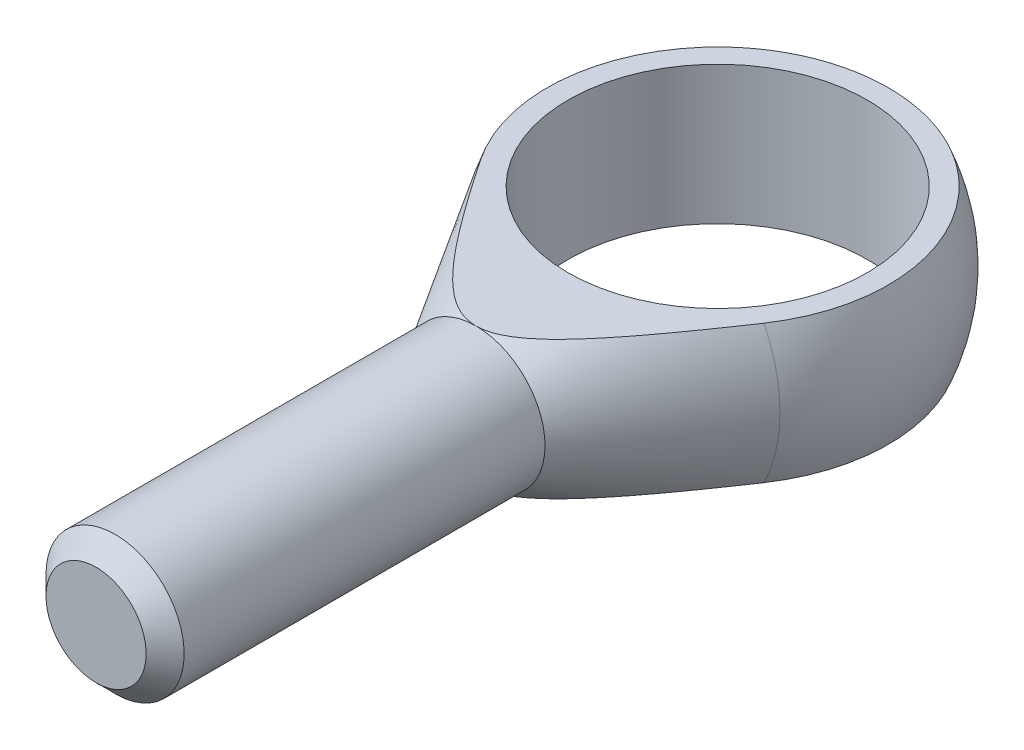
ISO-10303-21;
HEADER;
FILE_DESCRIPTION(('STEP AP214'),'2;1');
FILE_NAME('part.step','',(''),(''),'','','');
FILE_SCHEMA(('AUTOMOTIVE_DESIGN { 1 0 10303 214 1 1 1 1 }'));
ENDSEC;
DATA;
#1=APPLICATION_CONTEXT('core data for automotive mechanical design processes');
#2=APPLICATION_PROTOCOL_DEFINITION('international standard','automotive_design',2000,#1);
#3=PRODUCT_CONTEXT('',#1,'mechanical');
#4=PRODUCT('Part','Part','',(#3));
#5=PRODUCT_RELATED_PRODUCT_CATEGORY('part','',(#4));
#6=PRODUCT_DEFINITION_FORMATION('','',#4);
#7=PRODUCT_DEFINITION_CONTEXT('part definition',#1,'design');
#8=PRODUCT_DEFINITION('design','',#6,#7);
#9=PRODUCT_DEFINITION_SHAPE('','',#8);
#10=(LENGTH_UNIT() NAMED_UNIT(*) SI_UNIT(.MILLI.,.METRE.));
#11=(NAMED_UNIT(*) PLANE_ANGLE_UNIT() SI_UNIT($,.RADIAN.));
#12=(NAMED_UNIT(*) SI_UNIT($,.STERADIAN.) SOLID_ANGLE_UNIT());
#13=UNCERTAINTY_MEASURE_WITH_UNIT(LENGTH_MEASURE(1.E-05),#10,'distance_accuracy_value','');
#14=(GEOMETRIC_REPRESENTATION_CONTEXT(3) GLOBAL_UNCERTAINTY_ASSIGNED_CONTEXT((#13)) GLOBAL_UNIT_ASSIGNED_CONTEXT((#10,
#11,#12)) REPRESENTATION_CONTEXT('',''));
#15=CARTESIAN_POINT('',(0.,0.,0.));
#16=DIRECTION('',(0.,0.,1.));
#17=DIRECTION('',(1.,0.,0.));
#18=AXIS2_PLACEMENT_3D('',#15,#16,#17);
#19=CARTESIAN_POINT('',(0.,0.,21.));
#20=DIRECTION('',(0.,0.,-1.));
#21=DIRECTION('',(-1.,0.,0.));
#22=AXIS2_PLACEMENT_3D('',#19,#20,#21);
#23=CONICAL_SURFACE('',#22,6.,0.54381913603572);
#24=CARTESIAN_POINT('',(0.,0.,8.27852704456483));
#25=DIRECTION('',(0.,0.,-1.));
#26=DIRECTION('',(-1.,0.,0.));
#27=AXIS2_PLACEMENT_3D('',#24,#25,#26);
#28=CIRCLE('',#27,13.6918220106898);
#29=CARTESIAN_POINT('',(-12.3071519846148,-6.,8.27852704456483));
#30=VERTEX_POINT('',#29);
#31=CARTESIAN_POINT('',(-12.3071519846148,6.,8.27852704456483));
#32=VERTEX_POINT('',#31);
#33=EDGE_CURVE('E96',#30,#32,#28,.T.);
#34=ORIENTED_EDGE('',*,*,#33,.F.);
#35=CARTESIAN_POINT('',(-31.3799882104958,-6.,-21.9160405435385));
#36=CARTESIAN_POINT('',(-30.9346155893106,-6.,-21.1925500495504));
#37=CARTESIAN_POINT('',(-30.4890034582179,-6.,-20.4692070155686));
#38=CARTESIAN_POINT('',(-29.5972262334052,-6.,-19.022861540835));
#39=CARTESIAN_POINT('',(-29.1510611394851,-6.,-18.2998591002066));
#40=CARTESIAN_POINT('',(-27.8115766615616,-6.,-16.1313521166251));
#41=CARTESIAN_POINT('',(-26.9173172646921,-6.,-14.6864278449652));
#42=CARTESIAN_POINT('',(-25.1235923096148,-6.,-11.7956444903462));
#43=CARTESIAN_POINT('',(-24.2241197878063,-6.,-10.3497897269972));
#44=CARTESIAN_POINT('',(-22.4206158394495,-6.,-7.46102313765912));
#45=CARTESIAN_POINT('',(-21.5165846430345,-6.,-6.01811116817422));
#46=CARTESIAN_POINT('',(-20.126860696282,-6.,-3.81129437405455));
#47=CARTESIAN_POINT('',(-19.6435464141357,-6.,-3.04589194963399));
#48=CARTESIAN_POINT('',(-18.6745854110955,-6.,-1.51656533446917));
#49=CARTESIAN_POINT('',(-18.1889386929651,-6.,-0.75264114197502));
#50=CARTESIAN_POINT('',(-17.2146421972767,-6.,0.773463680413597));
#51=CARTESIAN_POINT('',(-16.7259919498118,-6.,1.53564401048951));
#52=CARTESIAN_POINT('',(-15.7449501334085,-6.,3.05758567398117));
#53=CARTESIAN_POINT('',(-15.2525585992186,-6.,3.81734702977121));
#54=CARTESIAN_POINT('',(-14.2634801806534,-6.,5.33272583238984));
#55=CARTESIAN_POINT('',(-13.766799392861,-6.,6.08834725487742));
#56=CARTESIAN_POINT('',(-12.7668366966786,-6.,7.59526672419474));
#57=CARTESIAN_POINT('',(-12.2635545265885,-6.,8.34656459791599));
#58=CARTESIAN_POINT('',(-11.5017822788204,-6.,9.46871748550414));
#59=CARTESIAN_POINT('',(-11.2467510177423,-6.,9.84192022113506));
#60=CARTESIAN_POINT('',(-10.7339025234583,-6.,10.5864052204217));
#61=CARTESIAN_POINT('',(-10.4760853093945,-6.,10.9576874972468));
#62=CARTESIAN_POINT('',(-9.95708575881299,-6.,11.6978551503882));
#63=CARTESIAN_POINT('',(-9.69590366612362,-6.,12.0667406974964));
#64=CARTESIAN_POINT('',(-9.16937247619287,-6.,12.8015219736493));
#65=CARTESIAN_POINT('',(-8.90402346502942,-6.,13.1674177642181));
#66=CARTESIAN_POINT('',(-8.460014194362,-6.,13.7704906969663));
#67=CARTESIAN_POINT('',(-8.28284323101851,-6.,14.0087640172321));
#68=CARTESIAN_POINT('',(-7.92583684483059,-6.,14.48331778095));
#69=CARTESIAN_POINT('',(-7.74600136081962,-6.,14.7195981784568));
#70=CARTESIAN_POINT('',(-7.38305426531327,-6.,15.1898992353419));
#71=CARTESIAN_POINT('',(-7.19994043221562,-6.,15.4239181830393));
#72=CARTESIAN_POINT('',(-6.82994411624043,-6.,15.8889550963289));
#73=CARTESIAN_POINT('',(-6.64306172541067,-6.,16.1199731349927));
#74=CARTESIAN_POINT('',(-6.26537430423413,-6.,16.577467845376));
#75=CARTESIAN_POINT('',(-6.07458481474136,-6.,16.803957312042));
#76=CARTESIAN_POINT('',(-5.68745941935048,-6.,17.2521406916316));
#77=CARTESIAN_POINT('',(-5.49112386393112,-6.,17.4738349060306));
#78=CARTESIAN_POINT('',(-5.09175015278233,-6.,17.910725013741));
#79=CARTESIAN_POINT('',(-4.88871884774234,-6.,18.125927142489));
#80=CARTESIAN_POINT('',(-4.47404371281153,-6.,18.5478259059901));
#81=CARTESIAN_POINT('',(-4.26240251355695,-6.,18.7545251004523));
#82=CARTESIAN_POINT('',(-3.88946376517466,-6.,19.0993151487996));
#83=CARTESIAN_POINT('',(-3.73084066141112,-6.,19.240287631417));
#84=CARTESIAN_POINT('',(-3.40674953052468,-6.,19.5143095980893));
#85=CARTESIAN_POINT('',(-3.24127918962299,-6.,19.6473563662652));
#86=CARTESIAN_POINT('',(-2.90281116121088,-6.,19.9024579565511));
#87=CARTESIAN_POINT('',(-2.72983943598837,-6.,20.024546803352));
#88=CARTESIAN_POINT('',(-2.37476302906092,-6.,20.2544269996832));
#89=CARTESIAN_POINT('',(-2.19266585087034,-6.,20.3622298385993));
#90=CARTESIAN_POINT('',(-1.7965747978339,-6.,20.5698544641381));
#91=CARTESIAN_POINT('',(-1.58131425638325,-6.,20.6673552282702));
#92=CARTESIAN_POINT('',(-1.24943088724608,-6.,20.7886986837656));
#93=CARTESIAN_POINT('',(-1.13732563638951,-6.,20.8249908644043));
#94=CARTESIAN_POINT('',(-0.910500826215442,-6.,20.8880927750263));
#95=CARTESIAN_POINT('',(-0.795782675289699,-6.,20.91490749051));
#96=CARTESIAN_POINT('',(-0.562915670696806,-6.,20.9582813929463));
#97=CARTESIAN_POINT('',(-0.444741850116909,-6.,20.9747080433463));
#98=CARTESIAN_POINT('',(-0.207353172159811,-6.,20.9960101114955));
#99=CARTESIAN_POINT('',(-0.0881383988865509,-6.,21.0008864539429));
#100=CARTESIAN_POINT('',(0.150170722889329,-6.,20.9988483726897));
#101=CARTESIAN_POINT('',(0.269265087453287,-6.,20.991935813276));
#102=CARTESIAN_POINT('',(0.506229209827387,-6.,20.9666640842946));
#103=CARTESIAN_POINT('',(0.624098810252515,-6.,20.9483034616746));
#104=CARTESIAN_POINT('',(0.870063607691504,-6.,20.8984503753296));
#105=CARTESIAN_POINT('',(0.997916706362346,-6.,20.865771218156));
#106=CARTESIAN_POINT('',(1.25014820189205,-6.,20.7889631603308));
#107=CARTESIAN_POINT('',(1.37452498767296,-6.,20.7448290453001));
#108=CARTESIAN_POINT('',(1.61959187065122,-6.,20.6467170078992));
#109=CARTESIAN_POINT('',(1.74027380218476,-6.,20.5927188950233));
#110=CARTESIAN_POINT('',(1.97759984990636,-6.,20.4765579671671));
#111=CARTESIAN_POINT('',(2.0942440478626,-6.,20.4143953176493));
#112=CARTESIAN_POINT('',(2.34728797757201,-6.,20.2698082894266));
#113=CARTESIAN_POINT('',(2.48280610860327,-6.,20.1858481797006));
#114=CARTESIAN_POINT('',(2.7486994638737,-6.,20.0101070576492));
#115=CARTESIAN_POINT('',(2.87907259019253,-6.,19.9183229022359));
#116=CARTESIAN_POINT('',(3.13537706565216,-6.,19.728388023541));
#117=CARTESIAN_POINT('',(3.26130133672617,-6.,19.6302278032431));
#118=CARTESIAN_POINT('',(3.50906304279529,-6.,19.4288721941432));
#119=CARTESIAN_POINT('',(3.63089995524097,-6.,19.3256761656454));
#120=CARTESIAN_POINT('',(3.87181155020788,-6.,19.1144634557711));
#121=CARTESIAN_POINT('',(3.99086110302297,-6.,19.0064182196495));
#122=CARTESIAN_POINT('',(4.22576989320534,-6.,18.7869184222835));
#123=CARTESIAN_POINT('',(4.34162904722421,-6.,18.6754637721292));
#124=CARTESIAN_POINT('',(4.57043082921461,-6.,18.4498409654308));
#125=CARTESIAN_POINT('',(4.68337635623869,-6.,18.3356757417746));
#126=CARTESIAN_POINT('',(4.90680448753394,-6.,18.1049746094091));
#127=CARTESIAN_POINT('',(5.01728718070854,-6.,17.9884387865651));
#128=CARTESIAN_POINT('',(5.36612173955582,-6.,17.6136742787642));
#129=CARTESIAN_POINT('',(5.60039459573932,-6.,17.351645352019));
#130=CARTESIAN_POINT('',(6.06102141083565,-6.,16.8206958939175));
#131=CARTESIAN_POINT('',(6.28737396203295,-6.,16.5517741520343));
#132=CARTESIAN_POINT('',(6.73394561712576,-6.,16.0086519655853));
#133=CARTESIAN_POINT('',(6.95416129148376,-6.,15.7344487087099));
#134=CARTESIAN_POINT('',(7.38959022012685,-6.,15.1820958625112));
#135=CARTESIAN_POINT('',(7.60480329932923,-6.,14.9039461356149));
#136=CARTESIAN_POINT('',(8.03161304260166,-6.,14.3439535338031));
#137=CARTESIAN_POINT('',(8.24320101632604,-6.,14.0621040483462));
#138=CARTESIAN_POINT('',(8.66301230278849,-6.,13.4959083591818));
#139=CARTESIAN_POINT('',(8.87123556827255,-6.,13.2115621204962));
#140=CARTESIAN_POINT('',(9.28480487958707,-6.,12.6409339975004));
#141=CARTESIAN_POINT('',(9.49015187484745,-6.,12.3546528004816));
#142=CARTESIAN_POINT('',(9.89847885118036,-6.,11.7804061382996));
#143=CARTESIAN_POINT('',(10.1014588147406,-6.,11.492440660699));
#144=CARTESIAN_POINT('',(10.7070127814102,-6.,10.6269859232812));
#145=CARTESIAN_POINT('',(11.106589327327,-6.,10.047399243146));
#146=CARTESIAN_POINT('',(11.8998426580399,-6.,8.88414957701882));
#147=CARTESIAN_POINT('',(12.293518981256,-6.,8.30048627729143));
#148=CARTESIAN_POINT('',(13.0758336013582,-6.,7.13085972480483));
#149=CARTESIAN_POINT('',(13.4644776187565,-6.,6.54490029437336));
#150=CARTESIAN_POINT('',(14.2382073625244,-6.,5.37066039390251));
#151=CARTESIAN_POINT('',(14.62329317672,-6.,4.78237998166535));
#152=CARTESIAN_POINT('',(15.3585771337857,-6.,3.65320122392585));
#153=CARTESIAN_POINT('',(15.7090021166038,-6.,3.11245047524019));
#154=CARTESIAN_POINT('',(16.4078846217464,-6.,2.02967869372597));
#155=CARTESIAN_POINT('',(16.7563421413753,-6.,1.48765765915846));
#156=CARTESIAN_POINT('',(17.7992758967793,-6.,-0.139985997389402));
#157=CARTESIAN_POINT('',(18.491305096419,-6.,-1.22717649251654));
#158=CARTESIAN_POINT('',(19.8710458348003,-6.,-3.40507585619151));
#159=CARTESIAN_POINT('',(20.5587549599765,-6.,-4.4957862514136));
#160=CARTESIAN_POINT('',(21.9306838432565,-6.,-6.67940044412453));
#161=CARTESIAN_POINT('',(22.614903596599,-6.,-7.77230424460346));
#162=CARTESIAN_POINT('',(23.9754505739948,-6.,-9.95140679246916));
#163=CARTESIAN_POINT('',(24.6517981283151,-6.,-11.0375928533262));
#164=CARTESIAN_POINT('',(26.0024350837802,-6.,-13.2112462075492));
#165=CARTESIAN_POINT('',(26.6767244811887,-6.,-14.2987135032362));
#166=CARTESIAN_POINT('',(28.0232688371092,-6.,-16.474024708846));
#167=CARTESIAN_POINT('',(28.6955247567213,-6.,-17.5618680240207));
#168=CARTESIAN_POINT('',(30.0386913186117,-6.,-19.7383803061851));
#169=CARTESIAN_POINT('',(30.7096019650269,-6.,-20.8270492706215));
#170=CARTESIAN_POINT('',(31.3799882104958,-6.,-21.9160405435385));
#171=B_SPLINE_CURVE_WITH_KNOTS('',3,(#35,#36,#37,#38,#39,#40,#41,#42,#43,#44,#45,#46,#47,#48,
#49,#50,#51,#52,#53,#54,#55,#56,#57,#58,#59,#60,#61,#62,#63,#64,#65,#66,#67,#68,#69,#70,#71,#72,
#73,#74,#75,#76,#77,#78,#79,#80,#81,#82,#83,#84,#85,#86,#87,#88,#89,#90,#91,#92,#93,#94,#95,#96,
#97,#98,#99,#100,#101,#102,#103,#104,#105,#106,#107,#108,#109,#110,#111,#112,#113,#114,#115,
#116,#117,#118,#119,#120,#121,#122,#123,#124,#125,#126,#127,#128,#129,#130,#131,#132,#133,#134,
#135,#136,#137,#138,#139,#140,#141,#142,#143,#144,#145,#146,#147,#148,#149,#150,#151,#152,#153,
#154,#155,#156,#157,#158,#159,#160,#161,#162,#163,#164,#165,#166,#167,#168,#169,#170),
.UNSPECIFIED.,.F.,.F.,(4,2,2,2,2,2,2,2,2,2,2,2,2,2,2,2,2,2,2,2,2,2,2,2,2,2,2,2,2,2,2,2,2,2,2,2,
2,2,2,2,2,2,2,2,2,2,2,2,2,2,2,2,2,2,2,2,2,2,2,2,2,2,2,2,2,2,2,4),(0.,2.54875593193632,
5.09751278693731,10.1953080539329,15.3037194775998,20.4118755473142,23.1275494787357,
25.8432201934323,28.5593271800134,31.2754089705693,33.9881162986551,36.7009314942169,
38.0569789987539,39.4130171918848,40.7689576693249,42.1248701732329,43.0156265925406,
43.9064034917678,44.7978087762971,45.689192314384,46.5775376812096,47.4658270348714,
48.3532341405091,49.240372117877,49.8768137316226,50.5134721929115,51.148079979075,
51.7821742498355,52.4887532523772,52.8419137574872,53.1948882095245,53.5522797734834,
53.9096427243062,54.2669491672919,54.6243009708509,55.0195714569588,55.4150221895645,
55.8112916253154,56.2075530315105,56.685462870433,57.1635656090708,57.642397568746,
58.1212905133223,58.6035168332439,59.085755739283,59.5674947065795,60.0492162558008,
61.1034322397133,62.1578346526929,63.2128149498721,64.267832114227,65.3250990205127,
66.3823807621877,67.4393048652418,68.4962367829284,70.6081073333659,72.7201422440188,
74.829517243714,76.9388400385749,78.8719365042182,80.8050356177013,84.6712791975568,
88.5395188314093,92.4077637421059,96.246408577892,100.085060377907,103.921461286108,
107.757850378947),.UNSPECIFIED.);
#172=CARTESIAN_POINT('',(0.,-6.,21.));
#173=VERTEX_POINT('',#172);
#174=EDGE_CURVE('E92',#30,#173,#171,.T.);
#175=ORIENTED_EDGE('',*,*,#174,.T.);
#176=CARTESIAN_POINT('',(0.,0.,21.));
#177=DIRECTION('',(0.,0.,-1.));
#178=DIRECTION('',(-1.,0.,0.));
#179=AXIS2_PLACEMENT_3D('',#176,#177,#178);
#180=CIRCLE('',#179,6.);
#181=CARTESIAN_POINT('',(0.,6.,21.));
#182=VERTEX_POINT('',#181);
#183=EDGE_CURVE('E91',#173,#182,#180,.T.);
#184=ORIENTED_EDGE('',*,*,#183,.T.);
#185=CARTESIAN_POINT('',(31.3799882104958,6.,-21.9160405435385));
#186=CARTESIAN_POINT('',(30.9346155893106,6.,-21.1925500495504));
#187=CARTESIAN_POINT('',(30.4890034582179,6.,-20.4692070155686));
#188=CARTESIAN_POINT('',(29.5972262334052,6.,-19.022861540835));
#189=CARTESIAN_POINT('',(29.1510611394851,6.,-18.2998591002066));
#190=CARTESIAN_POINT('',(27.8115766615616,6.,-16.1313521166251));
#191=CARTESIAN_POINT('',(26.9173172646921,6.,-14.6864278449652));
#192=CARTESIAN_POINT('',(25.1235923096148,6.,-11.7956444903462));
#193=CARTESIAN_POINT('',(24.2241197878063,6.,-10.3497897269972));
#194=CARTESIAN_POINT('',(22.4206158394495,6.,-7.46102313765912));
#195=CARTESIAN_POINT('',(21.5165846430345,6.,-6.01811116817422));
#196=CARTESIAN_POINT('',(20.126860696282,6.,-3.81129437405455));
#197=CARTESIAN_POINT('',(19.6435464141357,6.,-3.04589194963399));
#198=CARTESIAN_POINT('',(18.6745854110955,6.,-1.51656533446917));
#199=CARTESIAN_POINT('',(18.1889386929651,6.,-0.75264114197502));
#200=CARTESIAN_POINT('',(17.2146421972767,6.,0.773463680413597));
#201=CARTESIAN_POINT('',(16.7259919498118,6.,1.53564401048951));
#202=CARTESIAN_POINT('',(15.7449501334085,6.,3.05758567398117));
#203=CARTESIAN_POINT('',(15.2525585992186,6.,3.81734702977121));
#204=CARTESIAN_POINT('',(14.2634801806534,6.,5.33272583238984));
#205=CARTESIAN_POINT('',(13.766799392861,6.,6.08834725487742));
#206=CARTESIAN_POINT('',(12.7668366966786,6.,7.59526672419474));
#207=CARTESIAN_POINT('',(12.2635545265885,6.,8.34656459791599));
#208=CARTESIAN_POINT('',(11.5017822788204,6.,9.46871748550414));
#209=CARTESIAN_POINT('',(11.2467510177423,6.,9.84192022113506));
#210=CARTESIAN_POINT('',(10.7339025234583,6.,10.5864052204217));
#211=CARTESIAN_POINT('',(10.4760853093945,6.,10.9576874972468));
#212=CARTESIAN_POINT('',(9.95708575881299,6.,11.6978551503882));
#213=CARTESIAN_POINT('',(9.69590366612362,6.,12.0667406974964));
#214=CARTESIAN_POINT('',(9.16937247619287,6.,12.8015219736493));
#215=CARTESIAN_POINT('',(8.90402346502942,6.,13.1674177642181));
#216=CARTESIAN_POINT('',(8.460014194362,6.,13.7704906969663));
#217=CARTESIAN_POINT('',(8.28284323101851,6.,14.0087640172321));
#218=CARTESIAN_POINT('',(7.92583684483059,6.,14.48331778095));
#219=CARTESIAN_POINT('',(7.74600136081962,6.,14.7195981784568));
#220=CARTESIAN_POINT('',(7.38305426531327,6.,15.1898992353419));
#221=CARTESIAN_POINT('',(7.19994043221562,6.,15.4239181830393));
#222=CARTESIAN_POINT('',(6.82994411624043,6.,15.8889550963289));
#223=CARTESIAN_POINT('',(6.64306172541067,6.,16.1199731349927));
#224=CARTESIAN_POINT('',(6.26537430423413,6.,16.577467845376));
#225=CARTESIAN_POINT('',(6.07458481474136,6.,16.803957312042));
#226=CARTESIAN_POINT('',(5.68745941935048,6.,17.2521406916316));
#227=CARTESIAN_POINT('',(5.49112386393112,6.,17.4738349060306));
#228=CARTESIAN_POINT('',(5.09175015278233,6.,17.910725013741));
#229=CARTESIAN_POINT('',(4.88871884774234,6.,18.125927142489));
#230=CARTESIAN_POINT('',(4.47404371281153,6.,18.5478259059901));
#231=CARTESIAN_POINT('',(4.26240251355695,6.,18.7545251004523));
#232=CARTESIAN_POINT('',(3.88946376517466,6.,19.0993151487996));
#233=CARTESIAN_POINT('',(3.73084066141112,6.,19.240287631417));
#234=CARTESIAN_POINT('',(3.40674953052468,6.,19.5143095980893));
#235=CARTESIAN_POINT('',(3.24127918962299,6.,19.6473563662652));
#236=CARTESIAN_POINT('',(2.90281116121088,6.,19.9024579565511));
#237=CARTESIAN_POINT('',(2.72983943598837,6.,20.024546803352));
#238=CARTESIAN_POINT('',(2.37476302906092,6.,20.2544269996832));
#239=CARTESIAN_POINT('',(2.19266585087034,6.,20.3622298385993));
#240=CARTESIAN_POINT('',(1.7965747978339,6.,20.5698544641381));
#241=CARTESIAN_POINT('',(1.58131425638325,6.,20.6673552282702));
#242=CARTESIAN_POINT('',(1.24943088724608,6.,20.7886986837656));
#243=CARTESIAN_POINT('',(1.13732563638951,6.,20.8249908644043));
#244=CARTESIAN_POINT('',(0.910500826215442,6.,20.8880927750263));
#245=CARTESIAN_POINT('',(0.795782675289699,6.,20.91490749051));
#246=CARTESIAN_POINT('',(0.562915670696806,6.,20.9582813929463));
#247=CARTESIAN_POINT('',(0.444741850116909,6.,20.9747080433463));
#248=CARTESIAN_POINT('',(0.207353172159811,6.,20.9960101114955));
#249=CARTESIAN_POINT('',(0.0881383988865509,6.,21.0008864539429));
#250=CARTESIAN_POINT('',(-0.150170722889329,6.,20.9988483726897));
#251=CARTESIAN_POINT('',(-0.269265087453287,6.,20.991935813276));
#252=CARTESIAN_POINT('',(-0.506229209827387,6.,20.9666640842946));
#253=CARTESIAN_POINT('',(-0.624098810252515,6.,20.9483034616746));
#254=CARTESIAN_POINT('',(-0.870063607691504,6.,20.8984503753296));
#255=CARTESIAN_POINT('',(-0.997916706362346,6.,20.865771218156));
#256=CARTESIAN_POINT('',(-1.25014820189205,6.,20.7889631603308));
#257=CARTESIAN_POINT('',(-1.37452498767296,6.,20.7448290453001));
#258=CARTESIAN_POINT('',(-1.61959187065122,6.,20.6467170078992));
#259=CARTESIAN_POINT('',(-1.74027380218476,6.,20.5927188950233));
#260=CARTESIAN_POINT('',(-1.97759984990636,6.,20.4765579671671));
#261=CARTESIAN_POINT('',(-2.0942440478626,6.,20.4143953176493));
#262=CARTESIAN_POINT('',(-2.34728797757201,6.,20.2698082894266));
#263=CARTESIAN_POINT('',(-2.48280610860327,6.,20.1858481797006));
#264=CARTESIAN_POINT('',(-2.7486994638737,6.,20.0101070576492));
#265=CARTESIAN_POINT('',(-2.87907259019253,6.,19.9183229022359));
#266=CARTESIAN_POINT('',(-3.13537706565216,6.,19.728388023541));
#267=CARTESIAN_POINT('',(-3.26130133672617,6.,19.6302278032431));
#268=CARTESIAN_POINT('',(-3.50906304279529,6.,19.4288721941432));
#269=CARTESIAN_POINT('',(-3.63089995524097,6.,19.3256761656454));
#270=CARTESIAN_POINT('',(-3.87181155020788,6.,19.1144634557711));
#271=CARTESIAN_POINT('',(-3.99086110302297,6.,19.0064182196495));
#272=CARTESIAN_POINT('',(-4.22576989320534,6.,18.7869184222835));
#273=CARTESIAN_POINT('',(-4.34162904722421,6.,18.6754637721292));
#274=CARTESIAN_POINT('',(-4.57043082921461,6.,18.4498409654308));
#275=CARTESIAN_POINT('',(-4.68337635623869,6.,18.3356757417746));
#276=CARTESIAN_POINT('',(-4.90680448753394,6.,18.1049746094091));
#277=CARTESIAN_POINT('',(-5.01728718070854,6.,17.9884387865651));
#278=CARTESIAN_POINT('',(-5.36612173955582,6.,17.6136742787642));
#279=CARTESIAN_POINT('',(-5.60039459573932,6.,17.351645352019));
#280=CARTESIAN_POINT('',(-6.06102141083565,6.,16.8206958939175));
#281=CARTESIAN_POINT('',(-6.28737396203295,6.,16.5517741520343));
#282=CARTESIAN_POINT('',(-6.73394561712576,6.,16.0086519655853));
#283=CARTESIAN_POINT('',(-6.95416129148376,6.,15.7344487087099));
#284=CARTESIAN_POINT('',(-7.38959022012685,6.,15.1820958625112));
#285=CARTESIAN_POINT('',(-7.60480329932923,6.,14.9039461356149));
#286=CARTESIAN_POINT('',(-8.03161304260166,6.,14.3439535338031));
#287=CARTESIAN_POINT('',(-8.24320101632604,6.,14.0621040483462));
#288=CARTESIAN_POINT('',(-8.66301230278849,6.,13.4959083591818));
#289=CARTESIAN_POINT('',(-8.87123556827255,6.,13.2115621204962));
#290=CARTESIAN_POINT('',(-9.28480487958707,6.,12.6409339975004));
#291=CARTESIAN_POINT('',(-9.49015187484745,6.,12.3546528004816));
#292=CARTESIAN_POINT('',(-9.89847885118036,6.,11.7804061382996));
#293=CARTESIAN_POINT('',(-10.1014588147406,6.,11.492440660699));
#294=CARTESIAN_POINT('',(-10.7070127814102,6.,10.6269859232812));
#295=CARTESIAN_POINT('',(-11.106589327327,6.,10.047399243146));
#296=CARTESIAN_POINT('',(-11.8998426580399,6.,8.88414957701882));
#297=CARTESIAN_POINT('',(-12.293518981256,6.,8.30048627729143));
#298=CARTESIAN_POINT('',(-13.0758336013582,6.,7.13085972480483));
#299=CARTESIAN_POINT('',(-13.4644776187565,6.,6.54490029437336));
#300=CARTESIAN_POINT('',(-14.2382073625244,6.,5.37066039390251));
#301=CARTESIAN_POINT('',(-14.62329317672,6.,4.78237998166535));
#302=CARTESIAN_POINT('',(-15.3585771337857,6.,3.65320122392585));
#303=CARTESIAN_POINT('',(-15.7090021166038,6.,3.11245047524019));
#304=CARTESIAN_POINT('',(-16.4078846217464,6.,2.02967869372597));
#305=CARTESIAN_POINT('',(-16.7563421413753,6.,1.48765765915846));
#306=CARTESIAN_POINT('',(-17.7992758967793,6.,-0.139985997389402));
#307=CARTESIAN_POINT('',(-18.491305096419,6.,-1.22717649251654));
#308=CARTESIAN_POINT('',(-19.8710458348003,6.,-3.40507585619151));
#309=CARTESIAN_POINT('',(-20.5587549599765,6.,-4.4957862514136));
#310=CARTESIAN_POINT('',(-21.9306838432565,6.,-6.67940044412453));
#311=CARTESIAN_POINT('',(-22.614903596599,6.,-7.77230424460346));
#312=CARTESIAN_POINT('',(-23.9754505739948,6.,-9.95140679246916));
#313=CARTESIAN_POINT('',(-24.6517981283151,6.,-11.0375928533262));
#314=CARTESIAN_POINT('',(-26.0024350837802,6.,-13.2112462075492));
#315=CARTESIAN_POINT('',(-26.6767244811887,6.,-14.2987135032362));
#316=CARTESIAN_POINT('',(-28.0232688371092,6.,-16.474024708846));
#317=CARTESIAN_POINT('',(-28.6955247567213,6.,-17.5618680240207));
#318=CARTESIAN_POINT('',(-30.0386913186117,6.,-19.7383803061851));
#319=CARTESIAN_POINT('',(-30.7096019650269,6.,-20.8270492706215));
#320=CARTESIAN_POINT('',(-31.3799882104958,6.,-21.9160405435385));
#321=B_SPLINE_CURVE_WITH_KNOTS('',3,(#185,#186,#187,#188,#189,#190,#191,#192,#193,#194,#195,
#196,#197,#198,#199,#200,#201,#202,#203,#204,#205,#206,#207,#208,#209,#210,#211,#212,#213,#214,
#215,#216,#217,#218,#219,#220,#221,#222,#223,#224,#225,#226,#227,#228,#229,#230,#231,#232,#233,
#234,#235,#236,#237,#238,#239,#240,#241,#242,#243,#244,#245,#246,#247,#248,#249,#250,#251,#252,
#253,#254,#255,#256,#257,#258,#259,#260,#261,#262,#263,#264,#265,#266,#267,#268,#269,#270,#271,
#272,#273,#274,#275,#276,#277,#278,#279,#280,#281,#282,#283,#284,#285,#286,#287,#288,#289,#290,
#291,#292,#293,#294,#295,#296,#297,#298,#299,#300,#301,#302,#303,#304,#305,#306,#307,#308,#309,
#310,#311,#312,#313,#314,#315,#316,#317,#318,#319,#320),.UNSPECIFIED.,.F.,.F.,(4,2,2,2,2,2,2,2,
2,2,2,2,2,2,2,2,2,2,2,2,2,2,2,2,2,2,2,2,2,2,2,2,2,2,2,2,2,2,2,2,2,2,2,2,2,2,2,2,2,2,2,2,2,2,2,2,
2,2,2,2,2,2,2,2,2,2,2,4),(0.,2.54875593193632,5.09751278693731,10.1953080539329,
15.3037194775998,20.4118755473142,23.1275494787357,25.8432201934323,28.5593271800134,
31.2754089705693,33.9881162986551,36.7009314942169,38.0569789987539,39.4130171918848,
40.7689576693249,42.1248701732329,43.0156265925406,43.9064034917678,44.7978087762971,
45.689192314384,46.5775376812096,47.4658270348714,48.3532341405091,49.240372117877,
49.8768137316226,50.5134721929115,51.148079979075,51.7821742498355,52.4887532523772,
52.8419137574872,53.1948882095245,53.5522797734834,53.9096427243062,54.2669491672919,
54.6243009708509,55.0195714569588,55.4150221895645,55.8112916253154,56.2075530315105,
56.685462870433,57.1635656090708,57.642397568746,58.1212905133223,58.6035168332439,
59.085755739283,59.5674947065795,60.0492162558008,61.1034322397133,62.1578346526929,
63.2128149498721,64.267832114227,65.3250990205127,66.3823807621877,67.4393048652418,
68.4962367829284,70.6081073333659,72.7201422440188,74.829517243714,76.9388400385749,
78.8719365042182,80.8050356177013,84.6712791975568,88.5395188314093,92.4077637421059,
96.246408577892,100.085060377907,103.921461286108,107.757850378947),.UNSPECIFIED.);
#322=EDGE_CURVE('E71',#182,#32,#321,.T.);
#323=ORIENTED_EDGE('',*,*,#322,.T.);
#324=EDGE_LOOP('',(#34,#175,#184,#323));
#325=FACE_BOUND('',#324,.T.);
#326=ADVANCED_FACE('F36',(#325),#23,.T.);
#327=EDGE_CURVE('E86',#182,#173,#180,.T.);
#328=ORIENTED_EDGE('',*,*,#327,.T.);
#329=CARTESIAN_POINT('',(12.3071519846148,-6.,8.27852704456483));
#330=VERTEX_POINT('',#329);
#331=EDGE_CURVE('E88',#173,#330,#171,.T.);
#332=ORIENTED_EDGE('',*,*,#331,.T.);
#333=CARTESIAN_POINT('',(12.3071519846148,6.,8.27852704456483));
#334=VERTEX_POINT('',#333);
#335=EDGE_CURVE('E87',#334,#330,#28,.T.);
#336=ORIENTED_EDGE('',*,*,#335,.F.);
#337=EDGE_CURVE('E74',#334,#182,#321,.T.);
#338=ORIENTED_EDGE('',*,*,#337,.T.);
#339=EDGE_LOOP('',(#328,#332,#336,#338));
#340=FACE_BOUND('',#339,.T.);
#341=ADVANCED_FACE('F84',(#340),#23,.T.);
#342=CARTESIAN_POINT('',(0.,0.,0.));
#343=DIRECTION('',(0.,0.,-1.));
#344=DIRECTION('',(1.,0.,0.));
#345=AXIS2_PLACEMENT_3D('',#342,#343,#344);
#346=SPHERICAL_SURFACE('',#345,16.);
#347=CARTESIAN_POINT('',(0.,-6.,0.));
#348=DIRECTION('',(0.,1.,0.));
#349=DIRECTION('',(0.,0.,1.));
#350=AXIS2_PLACEMENT_3D('',#347,#348,#349);
#351=CIRCLE('',#350,14.8323969741913);
#352=EDGE_CURVE('E52',#330,#30,#351,.T.);
#353=ORIENTED_EDGE('',*,*,#352,.T.);
#354=ORIENTED_EDGE('',*,*,#33,.T.);
#355=CARTESIAN_POINT('',(0.,6.,0.));
#356=DIRECTION('',(0.,-1.,0.));
#357=DIRECTION('',(0.,0.,-1.));
#358=AXIS2_PLACEMENT_3D('',#355,#356,#357);
#359=CIRCLE('',#358,14.8323969741913);
#360=EDGE_CURVE('E76',#32,#334,#359,.T.);
#361=ORIENTED_EDGE('',*,*,#360,.T.);
#362=ORIENTED_EDGE('',*,*,#335,.T.);
#363=EDGE_LOOP('',(#353,#354,#361,#362));
#364=FACE_BOUND('',#363,.T.);
#365=ADVANCED_FACE('F124',(#364),#346,.T.);
#366=CARTESIAN_POINT('',(0.,0.,54.));
#367=DIRECTION('',(0.,0.,-1.));
#368=DIRECTION('',(-1.,0.,0.));
#369=AXIS2_PLACEMENT_3D('',#366,#367,#368);
#370=PLANE('',#369);
#371=CARTESIAN_POINT('',(0.,0.,54.));
#372=DIRECTION('',(0.,0.,-1.));
#373=DIRECTION('',(-1.,0.,0.));
#374=AXIS2_PLACEMENT_3D('',#371,#372,#373);
#375=CIRCLE('',#374,4.34999999999998);
#376=CARTESIAN_POINT('',(-4.34999999999998,0.,54.));
#377=VERTEX_POINT('',#376);
#378=EDGE_CURVE('E11',#377,#377,#375,.F.);
#379=ORIENTED_EDGE('',*,*,#378,.T.);
#380=EDGE_LOOP('',(#379));
#381=FACE_BOUND('',#380,.T.);
#382=ADVANCED_FACE('F142',(#381),#370,.F.);
#383=CARTESIAN_POINT('',(0.,0.,-26.0435164980697));
#384=DIRECTION('',(0.,0.,-1.));
#385=DIRECTION('',(-1.,0.,0.));
#386=AXIS2_PLACEMENT_3D('',#383,#384,#385);
#387=CYLINDRICAL_SURFACE('',#386,6.);
#388=CARTESIAN_POINT('',(0.,0.,52.35));
#389=DIRECTION('',(0.,0.,-1.));
#390=DIRECTION('',(-1.,0.,0.));
#391=AXIS2_PLACEMENT_3D('',#388,#389,#390);
#392=CIRCLE('',#391,6.);
#393=CARTESIAN_POINT('',(-6.,0.,52.35));
#394=VERTEX_POINT('',#393);
#395=EDGE_CURVE('E45',#394,#394,#392,.T.);
#396=ORIENTED_EDGE('',*,*,#395,.T.);
#397=EDGE_LOOP('',(#396));
#398=FACE_BOUND('',#397,.T.);
#399=ORIENTED_EDGE('',*,*,#327,.F.);
#400=ORIENTED_EDGE('',*,*,#183,.F.);
#401=EDGE_LOOP('',(#399,#400));
#402=FACE_BOUND('',#401,.T.);
#403=ADVANCED_FACE('F95',(#398,#402),#387,.T.);
#404=CARTESIAN_POINT('',(-16.,6.,21.));
#405=DIRECTION('',(0.,-1.,0.));
#406=DIRECTION('',(0.,0.,-1.));
#407=AXIS2_PLACEMENT_3D('',#404,#405,#406);
#408=PLANE('',#407);
#409=CARTESIAN_POINT('',(0.,6.00000000000001,0.));
#410=DIRECTION('',(0.,1.,0.));
#411=DIRECTION('',(0.,0.,1.));
#412=AXIS2_PLACEMENT_3D('',#409,#410,#411);
#413=CIRCLE('',#412,13.);
#414=CARTESIAN_POINT('',(0.,6.00000000000001,13.));
#415=VERTEX_POINT('',#414);
#416=EDGE_CURVE('E200',#415,#415,#413,.T.);
#417=ORIENTED_EDGE('',*,*,#416,.F.);
#418=EDGE_LOOP('',(#417));
#419=FACE_BOUND('',#418,.T.);
#420=ORIENTED_EDGE('',*,*,#337,.F.);
#421=ORIENTED_EDGE('',*,*,#360,.F.);
#422=ORIENTED_EDGE('',*,*,#322,.F.);
#423=EDGE_LOOP('',(#420,#421,#422));
#424=FACE_BOUND('',#423,.T.);
#425=ADVANCED_FACE('F73',(#419,#424),#408,.F.);
#426=CARTESIAN_POINT('',(-16.,-6.,21.));
#427=DIRECTION('',(0.,1.,0.));
#428=DIRECTION('',(0.,0.,1.));
#429=AXIS2_PLACEMENT_3D('',#426,#427,#428);
#430=PLANE('',#429);
#431=CARTESIAN_POINT('',(0.,-6.00000000000001,0.));
#432=DIRECTION('',(0.,1.,0.));
#433=DIRECTION('',(0.,0.,1.));
#434=AXIS2_PLACEMENT_3D('',#431,#432,#433);
#435=CIRCLE('',#434,13.);
#436=CARTESIAN_POINT('',(0.,-6.00000000000001,13.));
#437=VERTEX_POINT('',#436);
#438=EDGE_CURVE('E80',#437,#437,#435,.T.);
#439=ORIENTED_EDGE('',*,*,#438,.T.);
#440=EDGE_LOOP('',(#439));
#441=FACE_BOUND('',#440,.T.);
#442=ORIENTED_EDGE('',*,*,#174,.F.);
#443=ORIENTED_EDGE('',*,*,#352,.F.);
#444=ORIENTED_EDGE('',*,*,#331,.F.);
#445=EDGE_LOOP('',(#442,#443,#444));
#446=FACE_BOUND('',#445,.T.);
#447=ADVANCED_FACE('F116',(#441,#446),#430,.F.);
#448=CARTESIAN_POINT('',(0.,-6.00000000000001,0.));
#449=DIRECTION('',(0.,1.,0.));
#450=DIRECTION('',(0.,0.,1.));
#451=AXIS2_PLACEMENT_3D('',#448,#449,#450);
#452=CYLINDRICAL_SURFACE('',#451,13.);
#453=ORIENTED_EDGE('',*,*,#438,.F.);
#454=EDGE_LOOP('',(#453));
#455=FACE_BOUND('',#454,.T.);
#456=ORIENTED_EDGE('',*,*,#416,.T.);
#457=EDGE_LOOP('',(#456));
#458=FACE_BOUND('',#457,.T.);
#459=ADVANCED_FACE('F111',(#455,#458),#452,.F.);
#460=CARTESIAN_POINT('',(0.,0.,52.35));
#461=DIRECTION('',(0.,0.,-1.));
#462=DIRECTION('',(-1.,0.,0.));
#463=AXIS2_PLACEMENT_3D('',#460,#461,#462);
#464=CONICAL_SURFACE('',#463,6.,0.785398163397454);
#465=ORIENTED_EDGE('',*,*,#378,.F.);
#466=EDGE_LOOP('',(#465));
#467=FACE_BOUND('',#466,.T.);
#468=ORIENTED_EDGE('',*,*,#395,.F.);
#469=EDGE_LOOP('',(#468));
#470=FACE_BOUND('',#469,.T.);
#471=ADVANCED_FACE('F39',(#467,#470),#464,.T.);
#472=CLOSED_SHELL('',(#326,#341,#365,#382,#403,#425,#447,#459,#471));
#473=MANIFOLD_SOLID_BREP('B2',#472);
#474=ADVANCED_BREP_SHAPE_REPRESENTATION('',(#18,#473),#14);
#475=SHAPE_DEFINITION_REPRESENTATION(#9,#474);
ENDSEC;
END-ISO-10303-21;
